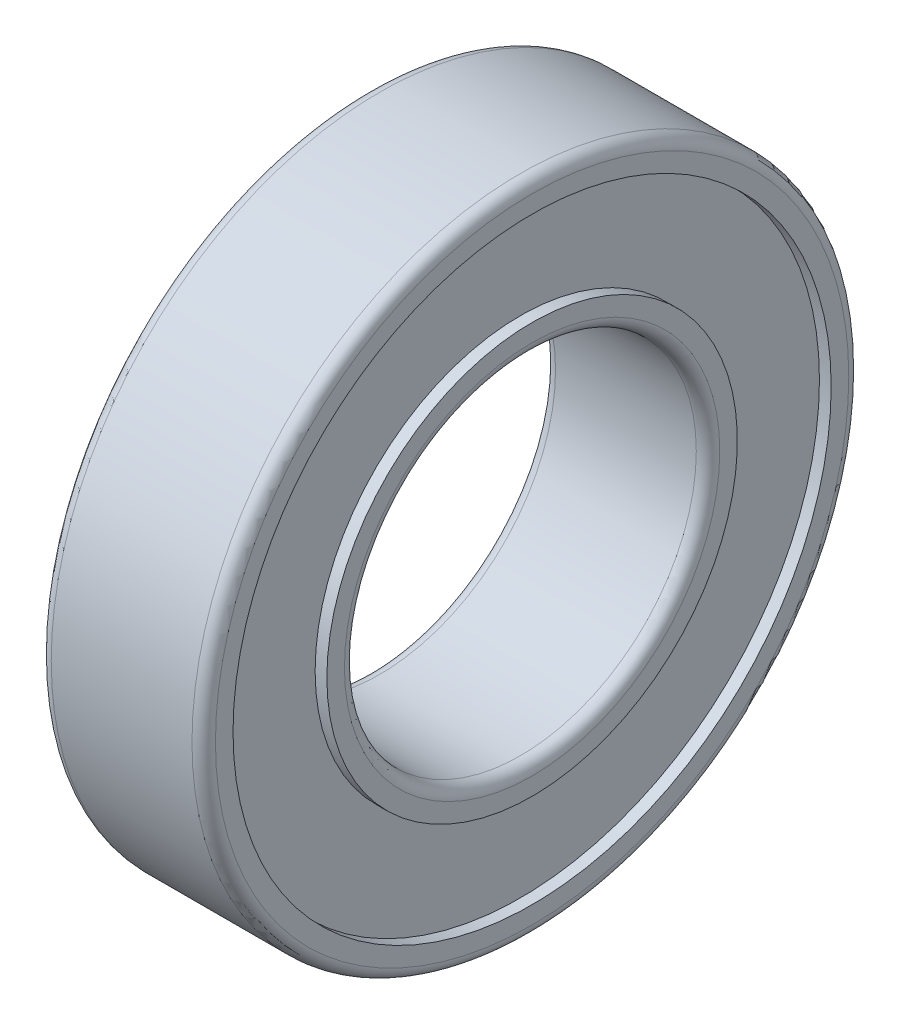
ISO-10303-21;
HEADER;
FILE_DESCRIPTION(('STEP AP214'),'2;1');
FILE_NAME('part.step','',(''),(''),'','','');
FILE_SCHEMA(('AUTOMOTIVE_DESIGN { 1 0 10303 214 1 1 1 1 }'));
ENDSEC;
DATA;
#1=APPLICATION_CONTEXT('core data for automotive mechanical design processes');
#2=APPLICATION_PROTOCOL_DEFINITION('international standard','automotive_design',2000,#1);
#3=PRODUCT_CONTEXT('',#1,'mechanical');
#4=PRODUCT('Part','Part','',(#3));
#5=PRODUCT_RELATED_PRODUCT_CATEGORY('part','',(#4));
#6=PRODUCT_DEFINITION_FORMATION('','',#4);
#7=PRODUCT_DEFINITION_CONTEXT('part definition',#1,'design');
#8=PRODUCT_DEFINITION('design','',#6,#7);
#9=PRODUCT_DEFINITION_SHAPE('','',#8);
#10=(LENGTH_UNIT() NAMED_UNIT(*) SI_UNIT(.MILLI.,.METRE.));
#11=(NAMED_UNIT(*) PLANE_ANGLE_UNIT() SI_UNIT($,.RADIAN.));
#12=(NAMED_UNIT(*) SI_UNIT($,.STERADIAN.) SOLID_ANGLE_UNIT());
#13=UNCERTAINTY_MEASURE_WITH_UNIT(LENGTH_MEASURE(1.E-05),#10,'distance_accuracy_value','');
#14=(GEOMETRIC_REPRESENTATION_CONTEXT(3) GLOBAL_UNCERTAINTY_ASSIGNED_CONTEXT((#13)) GLOBAL_UNIT_ASSIGNED_CONTEXT((#10,
#11,#12)) REPRESENTATION_CONTEXT('',''));
#15=CARTESIAN_POINT('',(0.,0.,0.));
#16=DIRECTION('',(0.,0.,1.));
#17=DIRECTION('',(1.,0.,0.));
#18=AXIS2_PLACEMENT_3D('',#15,#16,#17);
#19=CARTESIAN_POINT('',(0.5,12.75,0.));
#20=DIRECTION('',(1.,0.,0.));
#21=DIRECTION('',(0.,0.,-1.));
#22=AXIS2_PLACEMENT_3D('',#19,#20,#21);
#23=PLANE('',#22);
#24=CARTESIAN_POINT('',(0.5,0.,0.));
#25=DIRECTION('',(-1.,0.,0.));
#26=DIRECTION('',(0.,0.,1.));
#27=AXIS2_PLACEMENT_3D('',#24,#25,#26);
#28=CIRCLE('',#27,12.75);
#29=CARTESIAN_POINT('',(0.5,0.,12.75));
#30=VERTEX_POINT('',#29);
#31=EDGE_CURVE('E286',#30,#30,#28,.T.);
#32=ORIENTED_EDGE('',*,*,#31,.T.);
#33=EDGE_LOOP('',(#32));
#34=FACE_BOUND('',#33,.T.);
#35=CARTESIAN_POINT('',(0.5,0.,0.));
#36=DIRECTION('',(-1.,0.,0.));
#37=DIRECTION('',(0.,0.,1.));
#38=AXIS2_PLACEMENT_3D('',#35,#36,#37);
#39=CIRCLE('',#38,8.75);
#40=CARTESIAN_POINT('',(0.5,0.,8.75));
#41=VERTEX_POINT('',#40);
#42=EDGE_CURVE('E289',#41,#41,#39,.T.);
#43=ORIENTED_EDGE('',*,*,#42,.F.);
#44=EDGE_LOOP('',(#43));
#45=FACE_BOUND('',#44,.T.);
#46=ADVANCED_FACE('F16',(#34,#45),#23,.F.);
#47=CARTESIAN_POINT('',(0.,0.,0.));
#48=DIRECTION('',(-1.,0.,0.));
#49=DIRECTION('',(0.,0.,1.));
#50=AXIS2_PLACEMENT_3D('',#47,#48,#49);
#51=CYLINDRICAL_SURFACE('',#50,12.75);
#52=ORIENTED_EDGE('',*,*,#31,.F.);
#53=EDGE_LOOP('',(#52));
#54=FACE_BOUND('',#53,.T.);
#55=CARTESIAN_POINT('',(0.,0.,0.));
#56=DIRECTION('',(-1.,0.,0.));
#57=DIRECTION('',(0.,0.,1.));
#58=AXIS2_PLACEMENT_3D('',#55,#56,#57);
#59=CIRCLE('',#58,12.75);
#60=CARTESIAN_POINT('',(0.,0.,12.75));
#61=VERTEX_POINT('',#60);
#62=EDGE_CURVE('E285',#61,#61,#59,.T.);
#63=ORIENTED_EDGE('',*,*,#62,.T.);
#64=EDGE_LOOP('',(#63));
#65=FACE_BOUND('',#64,.T.);
#66=ADVANCED_FACE('F113',(#54,#65),#51,.F.);
#67=CARTESIAN_POINT('',(0.,0.,0.));
#68=DIRECTION('',(-1.,0.,0.));
#69=DIRECTION('',(0.,0.,1.));
#70=AXIS2_PLACEMENT_3D('',#67,#68,#69);
#71=CYLINDRICAL_SURFACE('',#70,8.75);
#72=CARTESIAN_POINT('',(0.,0.,0.));
#73=DIRECTION('',(-1.,0.,0.));
#74=DIRECTION('',(0.,0.,1.));
#75=AXIS2_PLACEMENT_3D('',#72,#73,#74);
#76=CIRCLE('',#75,8.75);
#77=CARTESIAN_POINT('',(0.,0.,8.75));
#78=VERTEX_POINT('',#77);
#79=EDGE_CURVE('E81',#78,#78,#76,.F.);
#80=ORIENTED_EDGE('',*,*,#79,.T.);
#81=EDGE_LOOP('',(#80));
#82=FACE_BOUND('',#81,.T.);
#83=ORIENTED_EDGE('',*,*,#42,.T.);
#84=EDGE_LOOP('',(#83));
#85=FACE_BOUND('',#84,.T.);
#86=ADVANCED_FACE('F101',(#82,#85),#71,.T.);
#87=CARTESIAN_POINT('',(0.,14.,0.));
#88=DIRECTION('',(1.,0.,0.));
#89=DIRECTION('',(0.,0.,-1.));
#90=AXIS2_PLACEMENT_3D('',#87,#88,#89);
#91=PLANE('',#90);
#92=ORIENTED_EDGE('',*,*,#62,.F.);
#93=EDGE_LOOP('',(#92));
#94=FACE_BOUND('',#93,.T.);
#95=CARTESIAN_POINT('',(0.,0.,0.));
#96=DIRECTION('',(1.,0.,0.));
#97=DIRECTION('',(0.,0.,-1.));
#98=AXIS2_PLACEMENT_3D('',#95,#96,#97);
#99=CIRCLE('',#98,13.5);
#100=CARTESIAN_POINT('',(0.,0.,-13.5));
#101=VERTEX_POINT('',#100);
#102=CARTESIAN_POINT('',(0.,0.,13.5));
#103=VERTEX_POINT('',#102);
#104=EDGE_CURVE('E65',#101,#103,#99,.T.);
#105=ORIENTED_EDGE('',*,*,#104,.F.);
#106=CARTESIAN_POINT('',(0.,0.,0.));
#107=DIRECTION('',(1.,0.,0.));
#108=DIRECTION('',(0.,0.,1.));
#109=AXIS2_PLACEMENT_3D('',#106,#107,#108);
#110=CIRCLE('',#109,13.5);
#111=EDGE_CURVE('E68',#103,#101,#110,.T.);
#112=ORIENTED_EDGE('',*,*,#111,.F.);
#113=EDGE_LOOP('',(#105,#112));
#114=FACE_BOUND('',#113,.T.);
#115=ADVANCED_FACE('F79',(#94,#114),#91,.F.);
#116=CARTESIAN_POINT('',(0.,8.75,0.));
#117=DIRECTION('',(1.,0.,0.));
#118=DIRECTION('',(0.,0.,-1.));
#119=AXIS2_PLACEMENT_3D('',#116,#117,#118);
#120=PLANE('',#119);
#121=ORIENTED_EDGE('',*,*,#79,.F.);
#122=EDGE_LOOP('',(#121));
#123=FACE_BOUND('',#122,.T.);
#124=CARTESIAN_POINT('',(0.,0.,0.));
#125=DIRECTION('',(-1.,0.,0.));
#126=DIRECTION('',(0.,0.,-1.));
#127=AXIS2_PLACEMENT_3D('',#124,#125,#126);
#128=CIRCLE('',#127,8.);
#129=CARTESIAN_POINT('',(0.,0.,-8.));
#130=VERTEX_POINT('',#129);
#131=CARTESIAN_POINT('',(0.,0.,8.));
#132=VERTEX_POINT('',#131);
#133=EDGE_CURVE('E75',#130,#132,#128,.T.);
#134=ORIENTED_EDGE('',*,*,#133,.F.);
#135=CARTESIAN_POINT('',(0.,0.,0.));
#136=DIRECTION('',(-1.,0.,0.));
#137=DIRECTION('',(0.,0.,1.));
#138=AXIS2_PLACEMENT_3D('',#135,#136,#137);
#139=CIRCLE('',#138,8.);
#140=EDGE_CURVE('E256',#132,#130,#139,.T.);
#141=ORIENTED_EDGE('',*,*,#140,.F.);
#142=EDGE_LOOP('',(#134,#141));
#143=FACE_BOUND('',#142,.T.);
#144=ADVANCED_FACE('F100',(#123,#143),#120,.F.);
#145=CARTESIAN_POINT('',(0.500000000000002,0.,0.));
#146=DIRECTION('',(1.,0.,0.));
#147=DIRECTION('',(0.,0.,-1.));
#148=AXIS2_PLACEMENT_3D('',#145,#146,#147);
#149=TOROIDAL_SURFACE('',#148,13.5,0.5);
#150=ORIENTED_EDGE('',*,*,#104,.T.);
#151=ORIENTED_EDGE('',*,*,#111,.T.);
#152=EDGE_LOOP('',(#150,#151));
#153=FACE_BOUND('',#152,.T.);
#154=CARTESIAN_POINT('',(0.500000000000002,0.,0.));
#155=DIRECTION('',(-1.,0.,0.));
#156=DIRECTION('',(0.,0.,1.));
#157=AXIS2_PLACEMENT_3D('',#154,#155,#156);
#158=CIRCLE('',#157,14.);
#159=CARTESIAN_POINT('',(0.500000000000002,0.,14.));
#160=VERTEX_POINT('',#159);
#161=EDGE_CURVE('E252',#160,#160,#158,.F.);
#162=ORIENTED_EDGE('',*,*,#161,.F.);
#163=EDGE_LOOP('',(#162));
#164=FACE_BOUND('',#163,.T.);
#165=ADVANCED_FACE('F70',(#153,#164),#149,.T.);
#166=CARTESIAN_POINT('',(0.5,0.,0.));
#167=DIRECTION('',(1.,0.,0.));
#168=DIRECTION('',(0.,0.,-1.));
#169=AXIS2_PLACEMENT_3D('',#166,#167,#168);
#170=TOROIDAL_SURFACE('',#169,8.,0.5);
#171=ORIENTED_EDGE('',*,*,#133,.T.);
#172=ORIENTED_EDGE('',*,*,#140,.T.);
#173=EDGE_LOOP('',(#171,#172));
#174=FACE_BOUND('',#173,.T.);
#175=CARTESIAN_POINT('',(0.5,0.,0.));
#176=DIRECTION('',(-1.,0.,0.));
#177=DIRECTION('',(0.,0.,1.));
#178=AXIS2_PLACEMENT_3D('',#175,#176,#177);
#179=CIRCLE('',#178,7.5);
#180=CARTESIAN_POINT('',(0.5,0.,7.5));
#181=VERTEX_POINT('',#180);
#182=EDGE_CURVE('E248',#181,#181,#179,.F.);
#183=ORIENTED_EDGE('',*,*,#182,.T.);
#184=EDGE_LOOP('',(#183));
#185=FACE_BOUND('',#184,.T.);
#186=ADVANCED_FACE('F232',(#174,#185),#170,.T.);
#187=CARTESIAN_POINT('',(0.,0.,0.));
#188=DIRECTION('',(-1.,0.,0.));
#189=DIRECTION('',(0.,0.,1.));
#190=AXIS2_PLACEMENT_3D('',#187,#188,#189);
#191=CYLINDRICAL_SURFACE('',#190,14.);
#192=CARTESIAN_POINT('',(6.5,0.,0.));
#193=DIRECTION('',(-1.,0.,0.));
#194=DIRECTION('',(0.,0.,1.));
#195=AXIS2_PLACEMENT_3D('',#192,#193,#194);
#196=CIRCLE('',#195,14.);
#197=CARTESIAN_POINT('',(6.5,0.,14.));
#198=VERTEX_POINT('',#197);
#199=EDGE_CURVE('E298',#198,#198,#196,.F.);
#200=ORIENTED_EDGE('',*,*,#199,.F.);
#201=EDGE_LOOP('',(#200));
#202=FACE_BOUND('',#201,.T.);
#203=ORIENTED_EDGE('',*,*,#161,.T.);
#204=EDGE_LOOP('',(#203));
#205=FACE_BOUND('',#204,.T.);
#206=ADVANCED_FACE('F242',(#202,#205),#191,.T.);
#207=CARTESIAN_POINT('',(0.,0.,0.));
#208=DIRECTION('',(-1.,0.,0.));
#209=DIRECTION('',(0.,0.,1.));
#210=AXIS2_PLACEMENT_3D('',#207,#208,#209);
#211=CYLINDRICAL_SURFACE('',#210,7.5);
#212=CARTESIAN_POINT('',(6.5,0.,0.));
#213=DIRECTION('',(-1.,0.,0.));
#214=DIRECTION('',(0.,0.,1.));
#215=AXIS2_PLACEMENT_3D('',#212,#213,#214);
#216=CIRCLE('',#215,7.5);
#217=CARTESIAN_POINT('',(6.5,0.,7.5));
#218=VERTEX_POINT('',#217);
#219=EDGE_CURVE('E301',#218,#218,#216,.T.);
#220=ORIENTED_EDGE('',*,*,#219,.F.);
#221=EDGE_LOOP('',(#220));
#222=FACE_BOUND('',#221,.T.);
#223=ORIENTED_EDGE('',*,*,#182,.F.);
#224=EDGE_LOOP('',(#223));
#225=FACE_BOUND('',#224,.T.);
#226=ADVANCED_FACE('F319',(#222,#225),#211,.F.);
#227=CARTESIAN_POINT('',(6.5,0.,0.));
#228=DIRECTION('',(-1.,0.,0.));
#229=DIRECTION('',(0.,0.,1.));
#230=AXIS2_PLACEMENT_3D('',#227,#228,#229);
#231=TOROIDAL_SURFACE('',#230,13.5,0.5);
#232=CARTESIAN_POINT('',(7.,0.,0.));
#233=DIRECTION('',(-1.,0.,0.));
#234=DIRECTION('',(0.,0.,1.));
#235=AXIS2_PLACEMENT_3D('',#232,#233,#234);
#236=CIRCLE('',#235,13.5);
#237=CARTESIAN_POINT('',(7.,0.,13.5));
#238=VERTEX_POINT('',#237);
#239=CARTESIAN_POINT('',(7.,0.,-13.5));
#240=VERTEX_POINT('',#239);
#241=EDGE_CURVE('E170',#238,#240,#236,.T.);
#242=ORIENTED_EDGE('',*,*,#241,.T.);
#243=CARTESIAN_POINT('',(7.,0.,0.));
#244=DIRECTION('',(-1.,0.,0.));
#245=DIRECTION('',(0.,0.,-1.));
#246=AXIS2_PLACEMENT_3D('',#243,#244,#245);
#247=CIRCLE('',#246,13.5);
#248=EDGE_CURVE('E181',#240,#238,#247,.T.);
#249=ORIENTED_EDGE('',*,*,#248,.T.);
#250=EDGE_LOOP('',(#242,#249));
#251=FACE_BOUND('',#250,.T.);
#252=ORIENTED_EDGE('',*,*,#199,.T.);
#253=EDGE_LOOP('',(#252));
#254=FACE_BOUND('',#253,.T.);
#255=ADVANCED_FACE('F197',(#251,#254),#231,.T.);
#256=CARTESIAN_POINT('',(6.5,0.,0.));
#257=DIRECTION('',(-1.,0.,0.));
#258=DIRECTION('',(0.,0.,1.));
#259=AXIS2_PLACEMENT_3D('',#256,#257,#258);
#260=TOROIDAL_SURFACE('',#259,8.,0.5);
#261=CARTESIAN_POINT('',(7.,0.,0.));
#262=DIRECTION('',(1.,0.,0.));
#263=DIRECTION('',(0.,0.,1.));
#264=AXIS2_PLACEMENT_3D('',#261,#262,#263);
#265=CIRCLE('',#264,8.);
#266=CARTESIAN_POINT('',(7.,0.,8.));
#267=VERTEX_POINT('',#266);
#268=CARTESIAN_POINT('',(7.,0.,-8.));
#269=VERTEX_POINT('',#268);
#270=EDGE_CURVE('E291',#267,#269,#265,.T.);
#271=ORIENTED_EDGE('',*,*,#270,.T.);
#272=CARTESIAN_POINT('',(7.,0.,0.));
#273=DIRECTION('',(1.,0.,0.));
#274=DIRECTION('',(0.,0.,-1.));
#275=AXIS2_PLACEMENT_3D('',#272,#273,#274);
#276=CIRCLE('',#275,8.);
#277=EDGE_CURVE('E40',#269,#267,#276,.T.);
#278=ORIENTED_EDGE('',*,*,#277,.T.);
#279=EDGE_LOOP('',(#271,#278));
#280=FACE_BOUND('',#279,.T.);
#281=ORIENTED_EDGE('',*,*,#219,.T.);
#282=EDGE_LOOP('',(#281));
#283=FACE_BOUND('',#282,.T.);
#284=ADVANCED_FACE('F193',(#280,#283),#260,.T.);
#285=CARTESIAN_POINT('',(7.,12.75,0.));
#286=DIRECTION('',(-1.,0.,0.));
#287=DIRECTION('',(0.,0.,1.));
#288=AXIS2_PLACEMENT_3D('',#285,#286,#287);
#289=PLANE('',#288);
#290=CARTESIAN_POINT('',(7.,0.,0.));
#291=DIRECTION('',(-1.,0.,0.));
#292=DIRECTION('',(0.,0.,1.));
#293=AXIS2_PLACEMENT_3D('',#290,#291,#292);
#294=CIRCLE('',#293,12.75);
#295=CARTESIAN_POINT('',(7.,0.,12.75));
#296=VERTEX_POINT('',#295);
#297=EDGE_CURVE('E449',#296,#296,#294,.T.);
#298=ORIENTED_EDGE('',*,*,#297,.T.);
#299=EDGE_LOOP('',(#298));
#300=FACE_BOUND('',#299,.T.);
#301=ORIENTED_EDGE('',*,*,#241,.F.);
#302=ORIENTED_EDGE('',*,*,#248,.F.);
#303=EDGE_LOOP('',(#301,#302));
#304=FACE_BOUND('',#303,.T.);
#305=ADVANCED_FACE('F149',(#300,#304),#289,.F.);
#306=CARTESIAN_POINT('',(7.,7.5,0.));
#307=DIRECTION('',(-1.,0.,0.));
#308=DIRECTION('',(0.,0.,1.));
#309=AXIS2_PLACEMENT_3D('',#306,#307,#308);
#310=PLANE('',#309);
#311=CARTESIAN_POINT('',(7.,0.,0.));
#312=DIRECTION('',(-1.,0.,0.));
#313=DIRECTION('',(0.,0.,1.));
#314=AXIS2_PLACEMENT_3D('',#311,#312,#313);
#315=CIRCLE('',#314,8.75);
#316=CARTESIAN_POINT('',(7.,0.,8.75));
#317=VERTEX_POINT('',#316);
#318=EDGE_CURVE('E451',#317,#317,#315,.T.);
#319=ORIENTED_EDGE('',*,*,#318,.F.);
#320=EDGE_LOOP('',(#319));
#321=FACE_BOUND('',#320,.T.);
#322=ORIENTED_EDGE('',*,*,#270,.F.);
#323=ORIENTED_EDGE('',*,*,#277,.F.);
#324=EDGE_LOOP('',(#322,#323));
#325=FACE_BOUND('',#324,.T.);
#326=ADVANCED_FACE('F144',(#321,#325),#310,.F.);
#327=CARTESIAN_POINT('',(0.,0.,0.));
#328=DIRECTION('',(-1.,0.,0.));
#329=DIRECTION('',(0.,0.,1.));
#330=AXIS2_PLACEMENT_3D('',#327,#328,#329);
#331=CYLINDRICAL_SURFACE('',#330,12.75);
#332=ORIENTED_EDGE('',*,*,#297,.F.);
#333=EDGE_LOOP('',(#332));
#334=FACE_BOUND('',#333,.T.);
#335=CARTESIAN_POINT('',(6.5,0.,0.));
#336=DIRECTION('',(-1.,0.,0.));
#337=DIRECTION('',(0.,0.,1.));
#338=AXIS2_PLACEMENT_3D('',#335,#336,#337);
#339=CIRCLE('',#338,12.75);
#340=CARTESIAN_POINT('',(6.5,0.,12.75));
#341=VERTEX_POINT('',#340);
#342=EDGE_CURVE('E28',#341,#341,#339,.T.);
#343=ORIENTED_EDGE('',*,*,#342,.T.);
#344=EDGE_LOOP('',(#343));
#345=FACE_BOUND('',#344,.T.);
#346=ADVANCED_FACE('F136',(#334,#345),#331,.F.);
#347=CARTESIAN_POINT('',(0.,0.,0.));
#348=DIRECTION('',(-1.,0.,0.));
#349=DIRECTION('',(0.,0.,1.));
#350=AXIS2_PLACEMENT_3D('',#347,#348,#349);
#351=CYLINDRICAL_SURFACE('',#350,8.75);
#352=CARTESIAN_POINT('',(6.5,0.,0.));
#353=DIRECTION('',(-1.,0.,0.));
#354=DIRECTION('',(0.,0.,1.));
#355=AXIS2_PLACEMENT_3D('',#352,#353,#354);
#356=CIRCLE('',#355,8.75);
#357=CARTESIAN_POINT('',(6.5,0.,8.75));
#358=VERTEX_POINT('',#357);
#359=EDGE_CURVE('E11',#358,#358,#356,.F.);
#360=ORIENTED_EDGE('',*,*,#359,.T.);
#361=EDGE_LOOP('',(#360));
#362=FACE_BOUND('',#361,.T.);
#363=ORIENTED_EDGE('',*,*,#318,.T.);
#364=EDGE_LOOP('',(#363));
#365=FACE_BOUND('',#364,.T.);
#366=ADVANCED_FACE('F128',(#362,#365),#351,.T.);
#367=CARTESIAN_POINT('',(6.5,8.75,0.));
#368=DIRECTION('',(-1.,0.,0.));
#369=DIRECTION('',(0.,0.,1.));
#370=AXIS2_PLACEMENT_3D('',#367,#368,#369);
#371=PLANE('',#370);
#372=ORIENTED_EDGE('',*,*,#359,.F.);
#373=EDGE_LOOP('',(#372));
#374=FACE_BOUND('',#373,.T.);
#375=ORIENTED_EDGE('',*,*,#342,.F.);
#376=EDGE_LOOP('',(#375));
#377=FACE_BOUND('',#376,.T.);
#378=ADVANCED_FACE('F126',(#374,#377),#371,.F.);
#379=CLOSED_SHELL('',(#46,#66,#86,#115,#144,#165,#186,#206,#226,#255,#284,#305,#326,#346,#366,#378));
#380=MANIFOLD_SOLID_BREP('B1',#379);
#381=ADVANCED_BREP_SHAPE_REPRESENTATION('',(#18,#380),#14);
#382=SHAPE_DEFINITION_REPRESENTATION(#9,#381);
ENDSEC;
END-ISO-10303-21;
